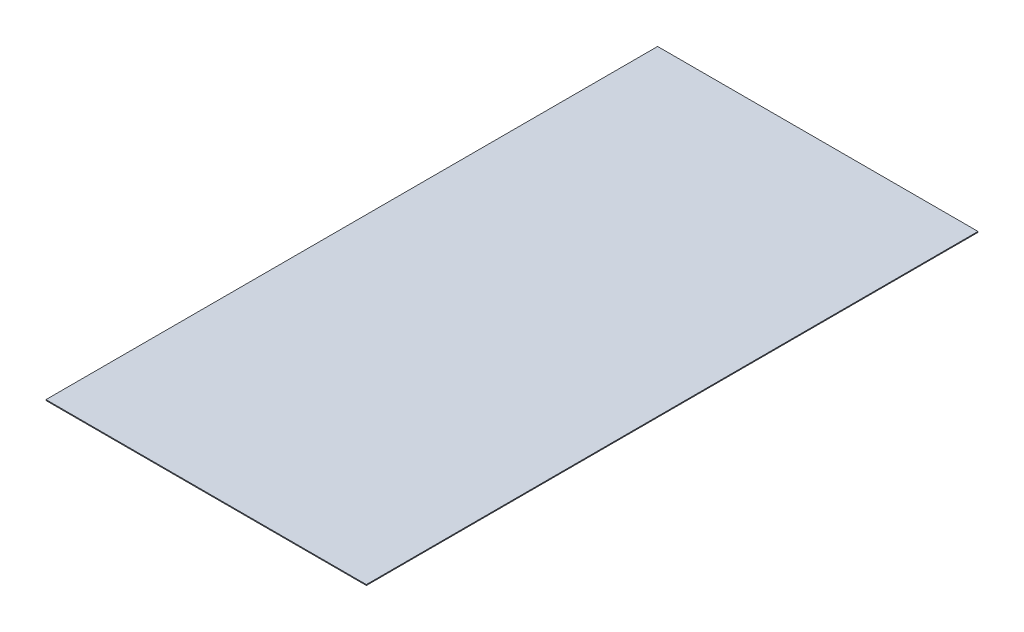
ISO-10303-21;
HEADER;
FILE_DESCRIPTION(('STEP AP214'),'2;1');
FILE_NAME('part.step','',(''),(''),'','','');
FILE_SCHEMA(('AUTOMOTIVE_DESIGN { 1 0 10303 214 1 1 1 1 }'));
ENDSEC;
DATA;
#1=APPLICATION_CONTEXT('core data for automotive mechanical design processes');
#2=APPLICATION_PROTOCOL_DEFINITION('international standard','automotive_design',2000,#1);
#3=PRODUCT_CONTEXT('',#1,'mechanical');
#4=PRODUCT('Part','Part','',(#3));
#5=PRODUCT_RELATED_PRODUCT_CATEGORY('part','',(#4));
#6=PRODUCT_DEFINITION_FORMATION('','',#4);
#7=PRODUCT_DEFINITION_CONTEXT('part definition',#1,'design');
#8=PRODUCT_DEFINITION('design','',#6,#7);
#9=PRODUCT_DEFINITION_SHAPE('','',#8);
#10=(LENGTH_UNIT() NAMED_UNIT(*) SI_UNIT(.MILLI.,.METRE.));
#11=(NAMED_UNIT(*) PLANE_ANGLE_UNIT() SI_UNIT($,.RADIAN.));
#12=(NAMED_UNIT(*) SI_UNIT($,.STERADIAN.) SOLID_ANGLE_UNIT());
#13=UNCERTAINTY_MEASURE_WITH_UNIT(LENGTH_MEASURE(1.E-05),#10,'distance_accuracy_value','');
#14=(GEOMETRIC_REPRESENTATION_CONTEXT(3) GLOBAL_UNCERTAINTY_ASSIGNED_CONTEXT((#13)) GLOBAL_UNIT_ASSIGNED_CONTEXT((#10,
#11,#12)) REPRESENTATION_CONTEXT('',''));
#15=CARTESIAN_POINT('',(0.,0.,0.));
#16=DIRECTION('',(0.,0.,1.));
#17=DIRECTION('',(1.,0.,0.));
#18=AXIS2_PLACEMENT_3D('',#15,#16,#17);
#19=CARTESIAN_POINT('',(550.,3.,1050.));
#20=DIRECTION('',(-1.,0.,0.));
#21=DIRECTION('',(0.,0.,1.));
#22=AXIS2_PLACEMENT_3D('',#19,#20,#21);
#23=PLANE('',#22);
#24=DIRECTION('',(0.,0.,-1.));
#25=VECTOR('',#24,1.);
#26=CARTESIAN_POINT('',(550.,0.,1050.));
#27=LINE('',#26,#25);
#28=CARTESIAN_POINT('',(550.,0.,1050.));
#29=VERTEX_POINT('',#28);
#30=CARTESIAN_POINT('',(550.,0.,-1050.));
#31=VERTEX_POINT('',#30);
#32=EDGE_CURVE('E97',#29,#31,#27,.T.);
#33=ORIENTED_EDGE('',*,*,#32,.T.);
#34=DIRECTION('',(0.,-1.,0.));
#35=VECTOR('',#34,1.);
#36=CARTESIAN_POINT('',(550.,3.,-1050.));
#37=LINE('',#36,#35);
#38=CARTESIAN_POINT('',(550.,3.,-1050.));
#39=VERTEX_POINT('',#38);
#40=EDGE_CURVE('E11',#39,#31,#37,.T.);
#41=ORIENTED_EDGE('',*,*,#40,.F.);
#42=DIRECTION('',(0.,0.,-1.));
#43=VECTOR('',#42,1.);
#44=CARTESIAN_POINT('',(550.,3.,1050.));
#45=LINE('',#44,#43);
#46=CARTESIAN_POINT('',(550.,3.,1050.));
#47=VERTEX_POINT('',#46);
#48=EDGE_CURVE('E85',#47,#39,#45,.T.);
#49=ORIENTED_EDGE('',*,*,#48,.F.);
#50=DIRECTION('',(0.,-1.,0.));
#51=VECTOR('',#50,1.);
#52=CARTESIAN_POINT('',(550.,3.,1050.));
#53=LINE('',#52,#51);
#54=EDGE_CURVE('E93',#47,#29,#53,.T.);
#55=ORIENTED_EDGE('',*,*,#54,.T.);
#56=EDGE_LOOP('',(#33,#41,#49,#55));
#57=FACE_BOUND('',#56,.T.);
#58=ADVANCED_FACE('F34',(#57),#23,.F.);
#59=CARTESIAN_POINT('',(-550.,3.,-1050.));
#60=DIRECTION('',(0.,0.,1.));
#61=DIRECTION('',(1.,0.,0.));
#62=AXIS2_PLACEMENT_3D('',#59,#60,#61);
#63=PLANE('',#62);
#64=DIRECTION('',(-1.,0.,0.));
#65=VECTOR('',#64,1.);
#66=CARTESIAN_POINT('',(-550.,0.,-1050.));
#67=LINE('',#66,#65);
#68=CARTESIAN_POINT('',(-550.,0.,-1050.));
#69=VERTEX_POINT('',#68);
#70=EDGE_CURVE('E89',#31,#69,#67,.T.);
#71=ORIENTED_EDGE('',*,*,#70,.T.);
#72=DIRECTION('',(0.,-1.,0.));
#73=VECTOR('',#72,1.);
#74=CARTESIAN_POINT('',(-550.,3.,-1050.));
#75=LINE('',#74,#73);
#76=CARTESIAN_POINT('',(-550.,3.,-1050.));
#77=VERTEX_POINT('',#76);
#78=EDGE_CURVE('E42',#77,#69,#75,.T.);
#79=ORIENTED_EDGE('',*,*,#78,.F.);
#80=DIRECTION('',(-1.,0.,0.));
#81=VECTOR('',#80,1.);
#82=CARTESIAN_POINT('',(-550.,3.,-1050.));
#83=LINE('',#82,#81);
#84=EDGE_CURVE('E80',#39,#77,#83,.T.);
#85=ORIENTED_EDGE('',*,*,#84,.F.);
#86=ORIENTED_EDGE('',*,*,#40,.T.);
#87=EDGE_LOOP('',(#71,#79,#85,#86));
#88=FACE_BOUND('',#87,.T.);
#89=ADVANCED_FACE('F88',(#88),#63,.F.);
#90=CARTESIAN_POINT('',(-550.,3.,1050.));
#91=DIRECTION('',(1.,0.,0.));
#92=DIRECTION('',(0.,0.,-1.));
#93=AXIS2_PLACEMENT_3D('',#90,#91,#92);
#94=PLANE('',#93);
#95=DIRECTION('',(0.,0.,1.));
#96=VECTOR('',#95,1.);
#97=CARTESIAN_POINT('',(-550.,0.,1050.));
#98=LINE('',#97,#96);
#99=CARTESIAN_POINT('',(-550.,0.,1050.));
#100=VERTEX_POINT('',#99);
#101=EDGE_CURVE('E67',#69,#100,#98,.T.);
#102=ORIENTED_EDGE('',*,*,#101,.T.);
#103=DIRECTION('',(0.,-1.,0.));
#104=VECTOR('',#103,1.);
#105=CARTESIAN_POINT('',(-550.,3.,1050.));
#106=LINE('',#105,#104);
#107=CARTESIAN_POINT('',(-550.,3.,1050.));
#108=VERTEX_POINT('',#107);
#109=EDGE_CURVE('E90',#108,#100,#106,.T.);
#110=ORIENTED_EDGE('',*,*,#109,.F.);
#111=DIRECTION('',(0.,0.,1.));
#112=VECTOR('',#111,1.);
#113=CARTESIAN_POINT('',(-550.,3.,1050.));
#114=LINE('',#113,#112);
#115=EDGE_CURVE('E83',#77,#108,#114,.T.);
#116=ORIENTED_EDGE('',*,*,#115,.F.);
#117=ORIENTED_EDGE('',*,*,#78,.T.);
#118=EDGE_LOOP('',(#102,#110,#116,#117));
#119=FACE_BOUND('',#118,.T.);
#120=ADVANCED_FACE('F91',(#119),#94,.F.);
#121=CARTESIAN_POINT('',(-550.,3.,1050.));
#122=DIRECTION('',(0.,0.,-1.));
#123=DIRECTION('',(-1.,0.,0.));
#124=AXIS2_PLACEMENT_3D('',#121,#122,#123);
#125=PLANE('',#124);
#126=DIRECTION('',(1.,0.,0.));
#127=VECTOR('',#126,1.);
#128=CARTESIAN_POINT('',(-550.,0.,1050.));
#129=LINE('',#128,#127);
#130=EDGE_CURVE('E73',#100,#29,#129,.T.);
#131=ORIENTED_EDGE('',*,*,#130,.T.);
#132=ORIENTED_EDGE('',*,*,#54,.F.);
#133=DIRECTION('',(1.,0.,0.));
#134=VECTOR('',#133,1.);
#135=CARTESIAN_POINT('',(-550.,3.,1050.));
#136=LINE('',#135,#134);
#137=EDGE_CURVE('E50',#108,#47,#136,.T.);
#138=ORIENTED_EDGE('',*,*,#137,.F.);
#139=ORIENTED_EDGE('',*,*,#109,.T.);
#140=EDGE_LOOP('',(#131,#132,#138,#139));
#141=FACE_BOUND('',#140,.T.);
#142=ADVANCED_FACE('F104',(#141),#125,.F.);
#143=CARTESIAN_POINT('',(0.,3.,0.));
#144=DIRECTION('',(0.,-1.,0.));
#145=DIRECTION('',(0.,0.,-1.));
#146=AXIS2_PLACEMENT_3D('',#143,#144,#145);
#147=PLANE('',#146);
#148=ORIENTED_EDGE('',*,*,#48,.T.);
#149=ORIENTED_EDGE('',*,*,#84,.T.);
#150=ORIENTED_EDGE('',*,*,#115,.T.);
#151=ORIENTED_EDGE('',*,*,#137,.T.);
#152=EDGE_LOOP('',(#148,#149,#150,#151));
#153=FACE_BOUND('',#152,.T.);
#154=ADVANCED_FACE('F81',(#153),#147,.F.);
#155=CARTESIAN_POINT('',(0.,0.,0.));
#156=DIRECTION('',(0.,-1.,0.));
#157=DIRECTION('',(0.,0.,-1.));
#158=AXIS2_PLACEMENT_3D('',#155,#156,#157);
#159=PLANE('',#158);
#160=ORIENTED_EDGE('',*,*,#32,.F.);
#161=ORIENTED_EDGE('',*,*,#130,.F.);
#162=ORIENTED_EDGE('',*,*,#101,.F.);
#163=ORIENTED_EDGE('',*,*,#70,.F.);
#164=EDGE_LOOP('',(#160,#161,#162,#163));
#165=FACE_BOUND('',#164,.T.);
#166=ADVANCED_FACE('F107',(#165),#159,.T.);
#167=CLOSED_SHELL('',(#58,#89,#120,#142,#154,#166));
#168=MANIFOLD_SOLID_BREP('B2',#167);
#169=ADVANCED_BREP_SHAPE_REPRESENTATION('',(#18,#168),#14);
#170=SHAPE_DEFINITION_REPRESENTATION(#9,#169);
ENDSEC;
END-ISO-10303-21;
